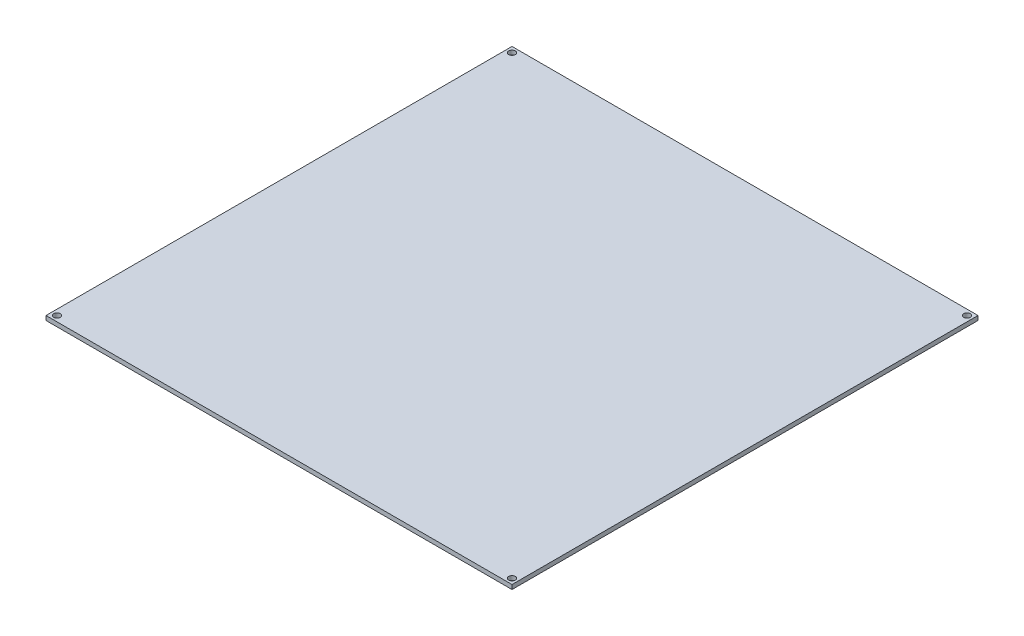
ISO-10303-21;
HEADER;
FILE_DESCRIPTION(('STEP AP214'),'2;1');
FILE_NAME('part.step','',(''),(''),'','','');
FILE_SCHEMA(('AUTOMOTIVE_DESIGN { 1 0 10303 214 1 1 1 1 }'));
ENDSEC;
DATA;
#1=APPLICATION_CONTEXT('core data for automotive mechanical design processes');
#2=APPLICATION_PROTOCOL_DEFINITION('international standard','automotive_design',2000,#1);
#3=PRODUCT_CONTEXT('',#1,'mechanical');
#4=PRODUCT('Part','Part','',(#3));
#5=PRODUCT_RELATED_PRODUCT_CATEGORY('part','',(#4));
#6=PRODUCT_DEFINITION_FORMATION('','',#4);
#7=PRODUCT_DEFINITION_CONTEXT('part definition',#1,'design');
#8=PRODUCT_DEFINITION('design','',#6,#7);
#9=PRODUCT_DEFINITION_SHAPE('','',#8);
#10=(LENGTH_UNIT() NAMED_UNIT(*) SI_UNIT(.MILLI.,.METRE.));
#11=(NAMED_UNIT(*) PLANE_ANGLE_UNIT() SI_UNIT($,.RADIAN.));
#12=(NAMED_UNIT(*) SI_UNIT($,.STERADIAN.) SOLID_ANGLE_UNIT());
#13=UNCERTAINTY_MEASURE_WITH_UNIT(LENGTH_MEASURE(1.E-05),#10,'distance_accuracy_value','');
#14=(GEOMETRIC_REPRESENTATION_CONTEXT(3) GLOBAL_UNCERTAINTY_ASSIGNED_CONTEXT((#13)) GLOBAL_UNIT_ASSIGNED_CONTEXT((#10,
#11,#12)) REPRESENTATION_CONTEXT('',''));
#15=CARTESIAN_POINT('',(0.,0.,0.));
#16=DIRECTION('',(0.,0.,1.));
#17=DIRECTION('',(1.,0.,0.));
#18=AXIS2_PLACEMENT_3D('',#15,#16,#17);
#19=CARTESIAN_POINT('',(0.,2.,0.));
#20=DIRECTION('',(0.,1.,0.));
#21=DIRECTION('',(0.,0.,1.));
#22=AXIS2_PLACEMENT_3D('',#19,#20,#21);
#23=PLANE('',#22);
#24=CARTESIAN_POINT('',(104.5,2.,104.5));
#25=DIRECTION('',(0.,1.,0.));
#26=DIRECTION('',(0.,0.,1.));
#27=AXIS2_PLACEMENT_3D('',#24,#25,#26);
#28=CIRCLE('',#27,1.50000000000008);
#29=CARTESIAN_POINT('',(104.5,2.,106.));
#30=VERTEX_POINT('',#29);
#31=EDGE_CURVE('E132',#30,#30,#28,.T.);
#32=ORIENTED_EDGE('',*,*,#31,.F.);
#33=EDGE_LOOP('',(#32));
#34=FACE_BOUND('',#33,.T.);
#35=CARTESIAN_POINT('',(-104.5,2.,-104.5));
#36=DIRECTION('',(0.,1.,0.));
#37=DIRECTION('',(0.,0.,1.));
#38=AXIS2_PLACEMENT_3D('',#35,#36,#37);
#39=CIRCLE('',#38,1.49999999999996);
#40=CARTESIAN_POINT('',(-104.5,2.,-103.));
#41=VERTEX_POINT('',#40);
#42=EDGE_CURVE('E111',#41,#41,#39,.T.);
#43=ORIENTED_EDGE('',*,*,#42,.F.);
#44=EDGE_LOOP('',(#43));
#45=FACE_BOUND('',#44,.T.);
#46=DIRECTION('',(-1.,0.,0.));
#47=VECTOR('',#46,1.);
#48=CARTESIAN_POINT('',(107.,2.,-107.));
#49=LINE('',#48,#47);
#50=CARTESIAN_POINT('',(107.,2.,-107.));
#51=VERTEX_POINT('',#50);
#52=CARTESIAN_POINT('',(-107.,2.,-107.));
#53=VERTEX_POINT('',#52);
#54=EDGE_CURVE('E96',#51,#53,#49,.T.);
#55=ORIENTED_EDGE('',*,*,#54,.T.);
#56=DIRECTION('',(0.,0.,1.));
#57=VECTOR('',#56,1.);
#58=CARTESIAN_POINT('',(-107.,2.,-107.));
#59=LINE('',#58,#57);
#60=CARTESIAN_POINT('',(-107.,2.,107.));
#61=VERTEX_POINT('',#60);
#62=EDGE_CURVE('E91',#53,#61,#59,.T.);
#63=ORIENTED_EDGE('',*,*,#62,.T.);
#64=DIRECTION('',(1.,0.,0.));
#65=VECTOR('',#64,1.);
#66=CARTESIAN_POINT('',(-107.,2.,107.));
#67=LINE('',#66,#65);
#68=CARTESIAN_POINT('',(107.,2.,107.));
#69=VERTEX_POINT('',#68);
#70=EDGE_CURVE('E94',#61,#69,#67,.T.);
#71=ORIENTED_EDGE('',*,*,#70,.T.);
#72=DIRECTION('',(0.,0.,-1.));
#73=VECTOR('',#72,1.);
#74=CARTESIAN_POINT('',(107.,2.,107.));
#75=LINE('',#74,#73);
#76=EDGE_CURVE('E61',#69,#51,#75,.T.);
#77=ORIENTED_EDGE('',*,*,#76,.T.);
#78=EDGE_LOOP('',(#55,#63,#71,#77));
#79=FACE_BOUND('',#78,.T.);
#80=CARTESIAN_POINT('',(104.5,2.,-104.5));
#81=DIRECTION('',(0.,1.,0.));
#82=DIRECTION('',(0.,0.,1.));
#83=AXIS2_PLACEMENT_3D('',#80,#81,#82);
#84=CIRCLE('',#83,1.49999999999997);
#85=CARTESIAN_POINT('',(104.5,2.,-103.));
#86=VERTEX_POINT('',#85);
#87=EDGE_CURVE('E126',#86,#86,#84,.T.);
#88=ORIENTED_EDGE('',*,*,#87,.F.);
#89=EDGE_LOOP('',(#88));
#90=FACE_BOUND('',#89,.T.);
#91=CARTESIAN_POINT('',(-104.5,2.,104.5));
#92=DIRECTION('',(0.,1.,0.));
#93=DIRECTION('',(0.,0.,1.));
#94=AXIS2_PLACEMENT_3D('',#91,#92,#93);
#95=CIRCLE('',#94,1.49999999999997);
#96=CARTESIAN_POINT('',(-104.5,2.,106.));
#97=VERTEX_POINT('',#96);
#98=EDGE_CURVE('E138',#97,#97,#95,.T.);
#99=ORIENTED_EDGE('',*,*,#98,.F.);
#100=EDGE_LOOP('',(#99));
#101=FACE_BOUND('',#100,.T.);
#102=ADVANCED_FACE('F44',(#34,#45,#79,#90,#101),#23,.T.);
#103=CARTESIAN_POINT('',(0.,0.,0.));
#104=DIRECTION('',(0.,1.,0.));
#105=DIRECTION('',(0.,0.,1.));
#106=AXIS2_PLACEMENT_3D('',#103,#104,#105);
#107=PLANE('',#106);
#108=DIRECTION('',(-1.,0.,0.));
#109=VECTOR('',#108,1.);
#110=CARTESIAN_POINT('',(107.,0.,-107.));
#111=LINE('',#110,#109);
#112=CARTESIAN_POINT('',(107.,0.,-107.));
#113=VERTEX_POINT('',#112);
#114=CARTESIAN_POINT('',(-107.,0.,-107.));
#115=VERTEX_POINT('',#114);
#116=EDGE_CURVE('E108',#113,#115,#111,.T.);
#117=ORIENTED_EDGE('',*,*,#116,.F.);
#118=DIRECTION('',(0.,0.,-1.));
#119=VECTOR('',#118,1.);
#120=CARTESIAN_POINT('',(107.,0.,107.));
#121=LINE('',#120,#119);
#122=CARTESIAN_POINT('',(107.,0.,107.));
#123=VERTEX_POINT('',#122);
#124=EDGE_CURVE('E84',#123,#113,#121,.T.);
#125=ORIENTED_EDGE('',*,*,#124,.F.);
#126=DIRECTION('',(1.,0.,0.));
#127=VECTOR('',#126,1.);
#128=CARTESIAN_POINT('',(-107.,0.,107.));
#129=LINE('',#128,#127);
#130=CARTESIAN_POINT('',(-107.,0.,107.));
#131=VERTEX_POINT('',#130);
#132=EDGE_CURVE('E78',#131,#123,#129,.T.);
#133=ORIENTED_EDGE('',*,*,#132,.F.);
#134=DIRECTION('',(0.,0.,1.));
#135=VECTOR('',#134,1.);
#136=CARTESIAN_POINT('',(-107.,0.,-107.));
#137=LINE('',#136,#135);
#138=EDGE_CURVE('E100',#115,#131,#137,.T.);
#139=ORIENTED_EDGE('',*,*,#138,.F.);
#140=EDGE_LOOP('',(#117,#125,#133,#139));
#141=FACE_BOUND('',#140,.T.);
#142=CARTESIAN_POINT('',(-104.5,0.,-104.5));
#143=DIRECTION('',(0.,1.,0.));
#144=DIRECTION('',(0.,0.,1.));
#145=AXIS2_PLACEMENT_3D('',#142,#143,#144);
#146=CIRCLE('',#145,1.49999999999996);
#147=CARTESIAN_POINT('',(-104.5,0.,-103.));
#148=VERTEX_POINT('',#147);
#149=EDGE_CURVE('E123',#148,#148,#146,.T.);
#150=ORIENTED_EDGE('',*,*,#149,.T.);
#151=EDGE_LOOP('',(#150));
#152=FACE_BOUND('',#151,.T.);
#153=CARTESIAN_POINT('',(104.5,0.,-104.5));
#154=DIRECTION('',(0.,1.,0.));
#155=DIRECTION('',(0.,0.,1.));
#156=AXIS2_PLACEMENT_3D('',#153,#154,#155);
#157=CIRCLE('',#156,1.49999999999997);
#158=CARTESIAN_POINT('',(104.5,0.,-103.));
#159=VERTEX_POINT('',#158);
#160=EDGE_CURVE('E129',#159,#159,#157,.T.);
#161=ORIENTED_EDGE('',*,*,#160,.T.);
#162=EDGE_LOOP('',(#161));
#163=FACE_BOUND('',#162,.T.);
#164=CARTESIAN_POINT('',(104.5,0.,104.5));
#165=DIRECTION('',(0.,1.,0.));
#166=DIRECTION('',(0.,0.,1.));
#167=AXIS2_PLACEMENT_3D('',#164,#165,#166);
#168=CIRCLE('',#167,1.50000000000008);
#169=CARTESIAN_POINT('',(104.5,0.,106.));
#170=VERTEX_POINT('',#169);
#171=EDGE_CURVE('E135',#170,#170,#168,.T.);
#172=ORIENTED_EDGE('',*,*,#171,.T.);
#173=EDGE_LOOP('',(#172));
#174=FACE_BOUND('',#173,.T.);
#175=CARTESIAN_POINT('',(-104.5,0.,104.5));
#176=DIRECTION('',(0.,1.,0.));
#177=DIRECTION('',(0.,0.,1.));
#178=AXIS2_PLACEMENT_3D('',#175,#176,#177);
#179=CIRCLE('',#178,1.49999999999997);
#180=CARTESIAN_POINT('',(-104.5,0.,106.));
#181=VERTEX_POINT('',#180);
#182=EDGE_CURVE('E141',#181,#181,#179,.T.);
#183=ORIENTED_EDGE('',*,*,#182,.T.);
#184=EDGE_LOOP('',(#183));
#185=FACE_BOUND('',#184,.T.);
#186=ADVANCED_FACE('F119',(#141,#152,#163,#174,#185),#107,.F.);
#187=CARTESIAN_POINT('',(107.,2.,-107.));
#188=DIRECTION('',(0.,0.,1.));
#189=DIRECTION('',(1.,0.,0.));
#190=AXIS2_PLACEMENT_3D('',#187,#188,#189);
#191=PLANE('',#190);
#192=ORIENTED_EDGE('',*,*,#116,.T.);
#193=DIRECTION('',(0.,-1.,0.));
#194=VECTOR('',#193,1.);
#195=CARTESIAN_POINT('',(-107.,2.,-107.));
#196=LINE('',#195,#194);
#197=EDGE_CURVE('E13',#53,#115,#196,.T.);
#198=ORIENTED_EDGE('',*,*,#197,.F.);
#199=ORIENTED_EDGE('',*,*,#54,.F.);
#200=DIRECTION('',(0.,-1.,0.));
#201=VECTOR('',#200,1.);
#202=CARTESIAN_POINT('',(107.,2.,-107.));
#203=LINE('',#202,#201);
#204=EDGE_CURVE('E104',#51,#113,#203,.T.);
#205=ORIENTED_EDGE('',*,*,#204,.T.);
#206=EDGE_LOOP('',(#192,#198,#199,#205));
#207=FACE_BOUND('',#206,.T.);
#208=ADVANCED_FACE('F46',(#207),#191,.F.);
#209=CARTESIAN_POINT('',(-107.,2.,-107.));
#210=DIRECTION('',(1.,0.,0.));
#211=DIRECTION('',(0.,0.,-1.));
#212=AXIS2_PLACEMENT_3D('',#209,#210,#211);
#213=PLANE('',#212);
#214=ORIENTED_EDGE('',*,*,#138,.T.);
#215=DIRECTION('',(0.,-1.,0.));
#216=VECTOR('',#215,1.);
#217=CARTESIAN_POINT('',(-107.,2.,107.));
#218=LINE('',#217,#216);
#219=EDGE_CURVE('E53',#61,#131,#218,.T.);
#220=ORIENTED_EDGE('',*,*,#219,.F.);
#221=ORIENTED_EDGE('',*,*,#62,.F.);
#222=ORIENTED_EDGE('',*,*,#197,.T.);
#223=EDGE_LOOP('',(#214,#220,#221,#222));
#224=FACE_BOUND('',#223,.T.);
#225=ADVANCED_FACE('F99',(#224),#213,.F.);
#226=CARTESIAN_POINT('',(-107.,2.,107.));
#227=DIRECTION('',(0.,0.,-1.));
#228=DIRECTION('',(-1.,0.,0.));
#229=AXIS2_PLACEMENT_3D('',#226,#227,#228);
#230=PLANE('',#229);
#231=ORIENTED_EDGE('',*,*,#132,.T.);
#232=DIRECTION('',(0.,-1.,0.));
#233=VECTOR('',#232,1.);
#234=CARTESIAN_POINT('',(107.,2.,107.));
#235=LINE('',#234,#233);
#236=EDGE_CURVE('E101',#69,#123,#235,.T.);
#237=ORIENTED_EDGE('',*,*,#236,.F.);
#238=ORIENTED_EDGE('',*,*,#70,.F.);
#239=ORIENTED_EDGE('',*,*,#219,.T.);
#240=EDGE_LOOP('',(#231,#237,#238,#239));
#241=FACE_BOUND('',#240,.T.);
#242=ADVANCED_FACE('F102',(#241),#230,.F.);
#243=CARTESIAN_POINT('',(107.,2.,107.));
#244=DIRECTION('',(-1.,0.,0.));
#245=DIRECTION('',(0.,0.,1.));
#246=AXIS2_PLACEMENT_3D('',#243,#244,#245);
#247=PLANE('',#246);
#248=ORIENTED_EDGE('',*,*,#124,.T.);
#249=ORIENTED_EDGE('',*,*,#204,.F.);
#250=ORIENTED_EDGE('',*,*,#76,.F.);
#251=ORIENTED_EDGE('',*,*,#236,.T.);
#252=EDGE_LOOP('',(#248,#249,#250,#251));
#253=FACE_BOUND('',#252,.T.);
#254=ADVANCED_FACE('F116',(#253),#247,.F.);
#255=CARTESIAN_POINT('',(-104.5,2.,-104.5));
#256=DIRECTION('',(0.,-1.,0.));
#257=DIRECTION('',(0.,0.,-1.));
#258=AXIS2_PLACEMENT_3D('',#255,#256,#257);
#259=CYLINDRICAL_SURFACE('',#258,1.49999999999996);
#260=ORIENTED_EDGE('',*,*,#42,.T.);
#261=EDGE_LOOP('',(#260));
#262=FACE_BOUND('',#261,.T.);
#263=ORIENTED_EDGE('',*,*,#149,.F.);
#264=EDGE_LOOP('',(#263));
#265=FACE_BOUND('',#264,.T.);
#266=ADVANCED_FACE('F160',(#262,#265),#259,.F.);
#267=CARTESIAN_POINT('',(104.5,2.,-104.5));
#268=DIRECTION('',(0.,-1.,0.));
#269=DIRECTION('',(0.,0.,-1.));
#270=AXIS2_PLACEMENT_3D('',#267,#268,#269);
#271=CYLINDRICAL_SURFACE('',#270,1.49999999999997);
#272=ORIENTED_EDGE('',*,*,#87,.T.);
#273=EDGE_LOOP('',(#272));
#274=FACE_BOUND('',#273,.T.);
#275=ORIENTED_EDGE('',*,*,#160,.F.);
#276=EDGE_LOOP('',(#275));
#277=FACE_BOUND('',#276,.T.);
#278=ADVANCED_FACE('F206',(#274,#277),#271,.F.);
#279=CARTESIAN_POINT('',(104.5,2.,104.5));
#280=DIRECTION('',(0.,-1.,0.));
#281=DIRECTION('',(0.,0.,-1.));
#282=AXIS2_PLACEMENT_3D('',#279,#280,#281);
#283=CYLINDRICAL_SURFACE('',#282,1.50000000000008);
#284=ORIENTED_EDGE('',*,*,#31,.T.);
#285=EDGE_LOOP('',(#284));
#286=FACE_BOUND('',#285,.T.);
#287=ORIENTED_EDGE('',*,*,#171,.F.);
#288=EDGE_LOOP('',(#287));
#289=FACE_BOUND('',#288,.T.);
#290=ADVANCED_FACE('F214',(#286,#289),#283,.F.);
#291=CARTESIAN_POINT('',(-104.5,2.,104.5));
#292=DIRECTION('',(0.,-1.,0.));
#293=DIRECTION('',(0.,0.,-1.));
#294=AXIS2_PLACEMENT_3D('',#291,#292,#293);
#295=CYLINDRICAL_SURFACE('',#294,1.49999999999997);
#296=ORIENTED_EDGE('',*,*,#98,.T.);
#297=EDGE_LOOP('',(#296));
#298=FACE_BOUND('',#297,.T.);
#299=ORIENTED_EDGE('',*,*,#182,.F.);
#300=EDGE_LOOP('',(#299));
#301=FACE_BOUND('',#300,.T.);
#302=ADVANCED_FACE('F147',(#298,#301),#295,.F.);
#303=CLOSED_SHELL('',(#102,#186,#208,#225,#242,#254,#266,#278,#290,#302));
#304=MANIFOLD_SOLID_BREP('B2',#303);
#305=ADVANCED_BREP_SHAPE_REPRESENTATION('',(#18,#304),#14);
#306=SHAPE_DEFINITION_REPRESENTATION(#9,#305);
ENDSEC;
END-ISO-10303-21;
